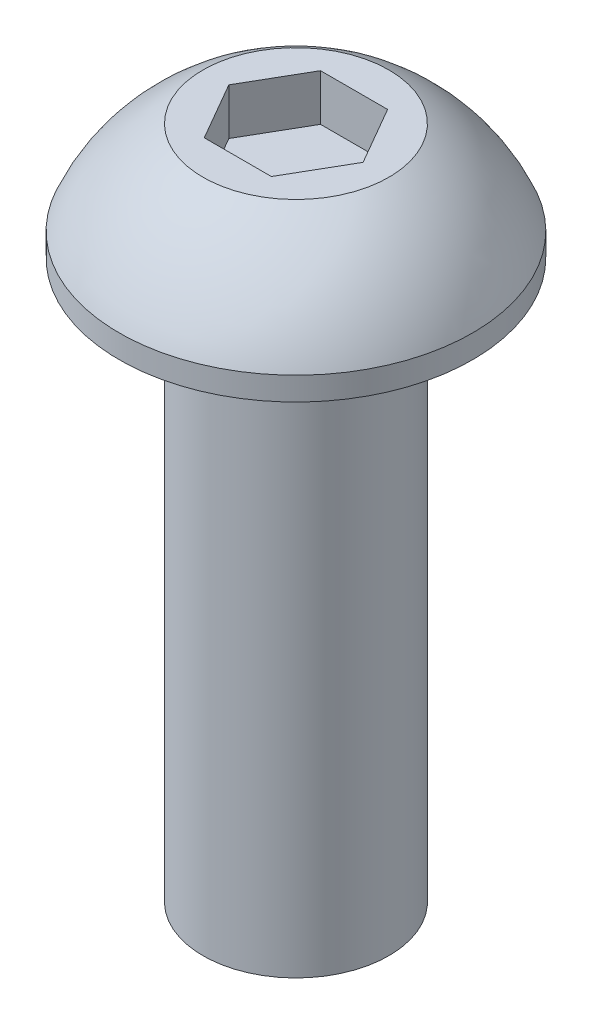
ISO-10303-21;
HEADER;
FILE_DESCRIPTION(('STEP AP214'),'2;1');
FILE_NAME('part.step','',(''),(''),'','','');
FILE_SCHEMA(('AUTOMOTIVE_DESIGN { 1 0 10303 214 1 1 1 1 }'));
ENDSEC;
DATA;
#1=APPLICATION_CONTEXT('core data for automotive mechanical design processes');
#2=APPLICATION_PROTOCOL_DEFINITION('international standard','automotive_design',2000,#1);
#3=PRODUCT_CONTEXT('',#1,'mechanical');
#4=PRODUCT('Part','Part','',(#3));
#5=PRODUCT_RELATED_PRODUCT_CATEGORY('part','',(#4));
#6=PRODUCT_DEFINITION_FORMATION('','',#4);
#7=PRODUCT_DEFINITION_CONTEXT('part definition',#1,'design');
#8=PRODUCT_DEFINITION('design','',#6,#7);
#9=PRODUCT_DEFINITION_SHAPE('','',#8);
#10=(LENGTH_UNIT() NAMED_UNIT(*) SI_UNIT(.MILLI.,.METRE.));
#11=(NAMED_UNIT(*) PLANE_ANGLE_UNIT() SI_UNIT($,.RADIAN.));
#12=(NAMED_UNIT(*) SI_UNIT($,.STERADIAN.) SOLID_ANGLE_UNIT());
#13=UNCERTAINTY_MEASURE_WITH_UNIT(LENGTH_MEASURE(1.E-05),#10,'distance_accuracy_value','');
#14=(GEOMETRIC_REPRESENTATION_CONTEXT(3) GLOBAL_UNCERTAINTY_ASSIGNED_CONTEXT((#13)) GLOBAL_UNIT_ASSIGNED_CONTEXT((#10,
#11,#12)) REPRESENTATION_CONTEXT('',''));
#15=CARTESIAN_POINT('',(0.,0.,0.));
#16=DIRECTION('',(0.,0.,1.));
#17=DIRECTION('',(1.,0.,0.));
#18=AXIS2_PLACEMENT_3D('',#15,#16,#17);
#19=CARTESIAN_POINT('',(0.,-12.,0.));
#20=DIRECTION('',(0.,-1.,0.));
#21=DIRECTION('',(0.,0.,-1.));
#22=AXIS2_PLACEMENT_3D('',#19,#20,#21);
#23=CYLINDRICAL_SURFACE('',#22,2.);
#24=CARTESIAN_POINT('',(0.,0.,0.));
#25=DIRECTION('',(0.,-1.,0.));
#26=DIRECTION('',(0.,0.,-1.));
#27=AXIS2_PLACEMENT_3D('',#24,#25,#26);
#28=CIRCLE('',#27,2.);
#29=CARTESIAN_POINT('',(0.,0.,-2.));
#30=VERTEX_POINT('',#29);
#31=EDGE_CURVE('E11',#30,#30,#28,.T.);
#32=ORIENTED_EDGE('',*,*,#31,.T.);
#33=EDGE_LOOP('',(#32));
#34=FACE_BOUND('',#33,.T.);
#35=CARTESIAN_POINT('',(0.,-12.,0.));
#36=DIRECTION('',(0.,-1.,0.));
#37=DIRECTION('',(0.,0.,-1.));
#38=AXIS2_PLACEMENT_3D('',#35,#36,#37);
#39=CIRCLE('',#38,2.);
#40=CARTESIAN_POINT('',(0.,-12.,-2.));
#41=VERTEX_POINT('',#40);
#42=EDGE_CURVE('E135',#41,#41,#39,.T.);
#43=ORIENTED_EDGE('',*,*,#42,.F.);
#44=EDGE_LOOP('',(#43));
#45=FACE_BOUND('',#44,.T.);
#46=ADVANCED_FACE('F34',(#34,#45),#23,.T.);
#47=CARTESIAN_POINT('',(2.,0.,0.));
#48=DIRECTION('',(0.,-1.,0.));
#49=DIRECTION('',(0.,0.,-1.));
#50=AXIS2_PLACEMENT_3D('',#47,#48,#49);
#51=PLANE('',#50);
#52=CARTESIAN_POINT('',(0.,0.,0.));
#53=DIRECTION('',(0.,-1.,0.));
#54=DIRECTION('',(0.,0.,-1.));
#55=AXIS2_PLACEMENT_3D('',#52,#53,#54);
#56=CIRCLE('',#55,3.8);
#57=CARTESIAN_POINT('',(0.,0.,-3.8));
#58=VERTEX_POINT('',#57);
#59=EDGE_CURVE('E41',#58,#58,#56,.T.);
#60=ORIENTED_EDGE('',*,*,#59,.T.);
#61=EDGE_LOOP('',(#60));
#62=FACE_BOUND('',#61,.T.);
#63=ORIENTED_EDGE('',*,*,#31,.F.);
#64=EDGE_LOOP('',(#63));
#65=FACE_BOUND('',#64,.T.);
#66=ADVANCED_FACE('F151',(#62,#65),#51,.T.);
#67=CARTESIAN_POINT('',(0.,-12.,0.));
#68=DIRECTION('',(0.,-1.,0.));
#69=DIRECTION('',(0.,0.,-1.));
#70=AXIS2_PLACEMENT_3D('',#67,#68,#69);
#71=CYLINDRICAL_SURFACE('',#70,3.8);
#72=CARTESIAN_POINT('',(0.,0.5,0.));
#73=DIRECTION('',(0.,-1.,0.));
#74=DIRECTION('',(0.,0.,-1.));
#75=AXIS2_PLACEMENT_3D('',#72,#73,#74);
#76=CIRCLE('',#75,3.8);
#77=CARTESIAN_POINT('',(0.,0.5,-3.8));
#78=VERTEX_POINT('',#77);
#79=EDGE_CURVE('E146',#78,#78,#76,.T.);
#80=ORIENTED_EDGE('',*,*,#79,.T.);
#81=EDGE_LOOP('',(#80));
#82=FACE_BOUND('',#81,.T.);
#83=ORIENTED_EDGE('',*,*,#59,.F.);
#84=EDGE_LOOP('',(#83));
#85=FACE_BOUND('',#84,.T.);
#86=ADVANCED_FACE('F154',(#82,#85),#71,.T.);
#87=CARTESIAN_POINT('',(0.,-1.01996448278049,0.));
#88=DIRECTION('',(0.,-1.,0.));
#89=DIRECTION('',(0.,0.,-1.));
#90=AXIS2_PLACEMENT_3D('',#87,#88,#89);
#91=DEGENERATE_TOROIDAL_SURFACE('',#90,0.100039463577234,4.,.T.);
#92=CARTESIAN_POINT('',(0.,2.5,0.));
#93=DIRECTION('',(0.,-1.,0.));
#94=DIRECTION('',(0.,0.,-1.));
#95=AXIS2_PLACEMENT_3D('',#92,#93,#94);
#96=CIRCLE('',#95,2.);
#97=CARTESIAN_POINT('',(0.,2.5,-2.));
#98=VERTEX_POINT('',#97);
#99=EDGE_CURVE('E143',#98,#98,#96,.T.);
#100=ORIENTED_EDGE('',*,*,#99,.T.);
#101=EDGE_LOOP('',(#100));
#102=FACE_BOUND('',#101,.T.);
#103=ORIENTED_EDGE('',*,*,#79,.F.);
#104=EDGE_LOOP('',(#103));
#105=FACE_BOUND('',#104,.T.);
#106=ADVANCED_FACE('F156',(#102,#105),#91,.T.);
#107=CARTESIAN_POINT('',(2.,2.5,0.));
#108=DIRECTION('',(0.,1.,0.));
#109=DIRECTION('',(0.,0.,1.));
#110=AXIS2_PLACEMENT_3D('',#107,#108,#109);
#111=PLANE('',#110);
#112=DIRECTION('',(-0.5,0.,-0.866025403784438));
#113=VECTOR('',#112,1.);
#114=CARTESIAN_POINT('',(1.44337567297406,2.5,0.));
#115=LINE('',#114,#113);
#116=CARTESIAN_POINT('',(1.44337567297406,2.5,0.));
#117=VERTEX_POINT('',#116);
#118=CARTESIAN_POINT('',(0.721687836487031,2.5,-1.25));
#119=VERTEX_POINT('',#118);
#120=EDGE_CURVE('E48',#117,#119,#115,.T.);
#121=ORIENTED_EDGE('',*,*,#120,.F.);
#122=DIRECTION('',(0.5,0.,-0.866025403784439));
#123=VECTOR('',#122,1.);
#124=CARTESIAN_POINT('',(0.721687836487032,2.5,1.25));
#125=LINE('',#124,#123);
#126=CARTESIAN_POINT('',(0.721687836487032,2.5,1.25));
#127=VERTEX_POINT('',#126);
#128=EDGE_CURVE('E131',#127,#117,#125,.T.);
#129=ORIENTED_EDGE('',*,*,#128,.F.);
#130=DIRECTION('',(1.,0.,0.));
#131=VECTOR('',#130,1.);
#132=CARTESIAN_POINT('',(-0.721687836487032,2.5,1.25));
#133=LINE('',#132,#131);
#134=CARTESIAN_POINT('',(-0.721687836487032,2.5,1.25));
#135=VERTEX_POINT('',#134);
#136=EDGE_CURVE('E129',#135,#127,#133,.T.);
#137=ORIENTED_EDGE('',*,*,#136,.F.);
#138=DIRECTION('',(0.5,0.,0.866025403784438));
#139=VECTOR('',#138,1.);
#140=CARTESIAN_POINT('',(-1.44337567297406,2.5,0.));
#141=LINE('',#140,#139);
#142=CARTESIAN_POINT('',(-1.44337567297406,2.5,0.));
#143=VERTEX_POINT('',#142);
#144=EDGE_CURVE('E96',#143,#135,#141,.T.);
#145=ORIENTED_EDGE('',*,*,#144,.F.);
#146=DIRECTION('',(-0.5,0.,0.866025403784439));
#147=VECTOR('',#146,1.);
#148=CARTESIAN_POINT('',(-0.721687836487033,2.5,-1.25));
#149=LINE('',#148,#147);
#150=CARTESIAN_POINT('',(-0.721687836487033,2.5,-1.25));
#151=VERTEX_POINT('',#150);
#152=EDGE_CURVE('E125',#151,#143,#149,.T.);
#153=ORIENTED_EDGE('',*,*,#152,.F.);
#154=DIRECTION('',(-1.,0.,0.));
#155=VECTOR('',#154,1.);
#156=CARTESIAN_POINT('',(0.721687836487031,2.5,-1.25));
#157=LINE('',#156,#155);
#158=EDGE_CURVE('E122',#119,#151,#157,.T.);
#159=ORIENTED_EDGE('',*,*,#158,.F.);
#160=EDGE_LOOP('',(#121,#129,#137,#145,#153,#159));
#161=FACE_BOUND('',#160,.T.);
#162=ORIENTED_EDGE('',*,*,#99,.F.);
#163=EDGE_LOOP('',(#162));
#164=FACE_BOUND('',#163,.T.);
#165=ADVANCED_FACE('F163',(#161,#164),#111,.T.);
#166=CARTESIAN_POINT('',(2.,-12.,0.));
#167=DIRECTION('',(0.,-1.,0.));
#168=DIRECTION('',(0.,0.,-1.));
#169=AXIS2_PLACEMENT_3D('',#166,#167,#168);
#170=PLANE('',#169);
#171=ORIENTED_EDGE('',*,*,#42,.T.);
#172=EDGE_LOOP('',(#171));
#173=FACE_BOUND('',#172,.T.);
#174=ADVANCED_FACE('F174',(#173),#170,.T.);
#175=CARTESIAN_POINT('',(1.44337567297406,1.5,0.));
#176=DIRECTION('',(0.866025403784438,0.,-0.5));
#177=DIRECTION('',(-0.5,0.,-0.866025403784438));
#178=AXIS2_PLACEMENT_3D('',#175,#176,#177);
#179=PLANE('',#178);
#180=ORIENTED_EDGE('',*,*,#120,.T.);
#181=DIRECTION('',(0.,1.,0.));
#182=VECTOR('',#181,1.);
#183=CARTESIAN_POINT('',(0.721687836487031,1.5,-1.25));
#184=LINE('',#183,#182);
#185=CARTESIAN_POINT('',(0.721687836487031,1.5,-1.25));
#186=VERTEX_POINT('',#185);
#187=EDGE_CURVE('E78',#186,#119,#184,.T.);
#188=ORIENTED_EDGE('',*,*,#187,.F.);
#189=DIRECTION('',(-0.5,0.,-0.866025403784438));
#190=VECTOR('',#189,1.);
#191=CARTESIAN_POINT('',(1.44337567297406,1.5,0.));
#192=LINE('',#191,#190);
#193=CARTESIAN_POINT('',(1.44337567297406,1.5,0.));
#194=VERTEX_POINT('',#193);
#195=EDGE_CURVE('E133',#194,#186,#192,.T.);
#196=ORIENTED_EDGE('',*,*,#195,.F.);
#197=DIRECTION('',(0.,1.,0.));
#198=VECTOR('',#197,1.);
#199=CARTESIAN_POINT('',(1.44337567297406,1.5,0.));
#200=LINE('',#199,#198);
#201=EDGE_CURVE('E56',#194,#117,#200,.T.);
#202=ORIENTED_EDGE('',*,*,#201,.T.);
#203=EDGE_LOOP('',(#180,#188,#196,#202));
#204=FACE_BOUND('',#203,.T.);
#205=ADVANCED_FACE('F176',(#204),#179,.F.);
#206=CARTESIAN_POINT('',(0.721687836487032,1.5,1.25));
#207=DIRECTION('',(0.866025403784439,0.,0.5));
#208=DIRECTION('',(0.5,0.,-0.866025403784439));
#209=AXIS2_PLACEMENT_3D('',#206,#207,#208);
#210=PLANE('',#209);
#211=ORIENTED_EDGE('',*,*,#128,.T.);
#212=ORIENTED_EDGE('',*,*,#201,.F.);
#213=DIRECTION('',(0.5,0.,-0.866025403784439));
#214=VECTOR('',#213,1.);
#215=CARTESIAN_POINT('',(0.721687836487032,1.5,1.25));
#216=LINE('',#215,#214);
#217=CARTESIAN_POINT('',(0.721687836487032,1.5,1.25));
#218=VERTEX_POINT('',#217);
#219=EDGE_CURVE('E108',#218,#194,#216,.T.);
#220=ORIENTED_EDGE('',*,*,#219,.F.);
#221=DIRECTION('',(0.,1.,0.));
#222=VECTOR('',#221,1.);
#223=CARTESIAN_POINT('',(0.721687836487032,1.5,1.25));
#224=LINE('',#223,#222);
#225=EDGE_CURVE('E100',#218,#127,#224,.T.);
#226=ORIENTED_EDGE('',*,*,#225,.T.);
#227=EDGE_LOOP('',(#211,#212,#220,#226));
#228=FACE_BOUND('',#227,.T.);
#229=ADVANCED_FACE('F182',(#228),#210,.F.);
#230=CARTESIAN_POINT('',(-0.721687836487032,1.5,1.25));
#231=DIRECTION('',(0.,0.,1.));
#232=DIRECTION('',(1.,0.,0.));
#233=AXIS2_PLACEMENT_3D('',#230,#231,#232);
#234=PLANE('',#233);
#235=ORIENTED_EDGE('',*,*,#136,.T.);
#236=ORIENTED_EDGE('',*,*,#225,.F.);
#237=DIRECTION('',(1.,0.,0.));
#238=VECTOR('',#237,1.);
#239=CARTESIAN_POINT('',(-0.721687836487032,1.5,1.25));
#240=LINE('',#239,#238);
#241=CARTESIAN_POINT('',(-0.721687836487032,1.5,1.25));
#242=VERTEX_POINT('',#241);
#243=EDGE_CURVE('E104',#242,#218,#240,.T.);
#244=ORIENTED_EDGE('',*,*,#243,.F.);
#245=DIRECTION('',(0.,1.,0.));
#246=VECTOR('',#245,1.);
#247=CARTESIAN_POINT('',(-0.721687836487032,1.5,1.25));
#248=LINE('',#247,#246);
#249=EDGE_CURVE('E89',#242,#135,#248,.T.);
#250=ORIENTED_EDGE('',*,*,#249,.T.);
#251=EDGE_LOOP('',(#235,#236,#244,#250));
#252=FACE_BOUND('',#251,.T.);
#253=ADVANCED_FACE('F105',(#252),#234,.F.);
#254=CARTESIAN_POINT('',(-1.44337567297406,1.5,0.));
#255=DIRECTION('',(-0.866025403784438,0.,0.5));
#256=DIRECTION('',(0.5,0.,0.866025403784438));
#257=AXIS2_PLACEMENT_3D('',#254,#255,#256);
#258=PLANE('',#257);
#259=ORIENTED_EDGE('',*,*,#144,.T.);
#260=ORIENTED_EDGE('',*,*,#249,.F.);
#261=DIRECTION('',(0.5,0.,0.866025403784438));
#262=VECTOR('',#261,1.);
#263=CARTESIAN_POINT('',(-1.44337567297406,1.5,0.));
#264=LINE('',#263,#262);
#265=CARTESIAN_POINT('',(-1.44337567297406,1.5,0.));
#266=VERTEX_POINT('',#265);
#267=EDGE_CURVE('E93',#266,#242,#264,.T.);
#268=ORIENTED_EDGE('',*,*,#267,.F.);
#269=DIRECTION('',(0.,1.,0.));
#270=VECTOR('',#269,1.);
#271=CARTESIAN_POINT('',(-1.44337567297406,1.5,0.));
#272=LINE('',#271,#270);
#273=EDGE_CURVE('E101',#266,#143,#272,.T.);
#274=ORIENTED_EDGE('',*,*,#273,.T.);
#275=EDGE_LOOP('',(#259,#260,#268,#274));
#276=FACE_BOUND('',#275,.T.);
#277=ADVANCED_FACE('F91',(#276),#258,.F.);
#278=CARTESIAN_POINT('',(-0.721687836487033,1.5,-1.25));
#279=DIRECTION('',(-0.866025403784439,0.,-0.5));
#280=DIRECTION('',(-0.5,0.,0.866025403784439));
#281=AXIS2_PLACEMENT_3D('',#278,#279,#280);
#282=PLANE('',#281);
#283=ORIENTED_EDGE('',*,*,#152,.T.);
#284=ORIENTED_EDGE('',*,*,#273,.F.);
#285=DIRECTION('',(-0.5,0.,0.866025403784439));
#286=VECTOR('',#285,1.);
#287=CARTESIAN_POINT('',(-0.721687836487033,1.5,-1.25));
#288=LINE('',#287,#286);
#289=CARTESIAN_POINT('',(-0.721687836487033,1.5,-1.25));
#290=VERTEX_POINT('',#289);
#291=EDGE_CURVE('E114',#290,#266,#288,.T.);
#292=ORIENTED_EDGE('',*,*,#291,.F.);
#293=DIRECTION('',(0.,1.,0.));
#294=VECTOR('',#293,1.);
#295=CARTESIAN_POINT('',(-0.721687836487033,1.5,-1.25));
#296=LINE('',#295,#294);
#297=EDGE_CURVE('E138',#290,#151,#296,.T.);
#298=ORIENTED_EDGE('',*,*,#297,.T.);
#299=EDGE_LOOP('',(#283,#284,#292,#298));
#300=FACE_BOUND('',#299,.T.);
#301=ADVANCED_FACE('F190',(#300),#282,.F.);
#302=CARTESIAN_POINT('',(0.721687836487031,1.5,-1.25));
#303=DIRECTION('',(0.,0.,-1.));
#304=DIRECTION('',(-1.,0.,0.));
#305=AXIS2_PLACEMENT_3D('',#302,#303,#304);
#306=PLANE('',#305);
#307=ORIENTED_EDGE('',*,*,#158,.T.);
#308=ORIENTED_EDGE('',*,*,#297,.F.);
#309=DIRECTION('',(-1.,0.,0.));
#310=VECTOR('',#309,1.);
#311=CARTESIAN_POINT('',(0.721687836487031,1.5,-1.25));
#312=LINE('',#311,#310);
#313=EDGE_CURVE('E116',#186,#290,#312,.T.);
#314=ORIENTED_EDGE('',*,*,#313,.F.);
#315=ORIENTED_EDGE('',*,*,#187,.T.);
#316=EDGE_LOOP('',(#307,#308,#314,#315));
#317=FACE_BOUND('',#316,.T.);
#318=ADVANCED_FACE('F187',(#317),#306,.F.);
#319=CARTESIAN_POINT('',(0.,1.5,0.));
#320=DIRECTION('',(0.,1.,0.));
#321=DIRECTION('',(0.,0.,1.));
#322=AXIS2_PLACEMENT_3D('',#319,#320,#321);
#323=PLANE('',#322);
#324=ORIENTED_EDGE('',*,*,#195,.T.);
#325=ORIENTED_EDGE('',*,*,#313,.T.);
#326=ORIENTED_EDGE('',*,*,#291,.T.);
#327=ORIENTED_EDGE('',*,*,#267,.T.);
#328=ORIENTED_EDGE('',*,*,#243,.T.);
#329=ORIENTED_EDGE('',*,*,#219,.T.);
#330=EDGE_LOOP('',(#324,#325,#326,#327,#328,#329));
#331=FACE_BOUND('',#330,.T.);
#332=ADVANCED_FACE('F111',(#331),#323,.T.);
#333=CLOSED_SHELL('',(#46,#66,#86,#106,#165,#174,#205,#229,#253,#277,#301,#318,#332));
#334=MANIFOLD_SOLID_BREP('B2',#333);
#335=ADVANCED_BREP_SHAPE_REPRESENTATION('',(#18,#334),#14);
#336=SHAPE_DEFINITION_REPRESENTATION(#9,#335);
ENDSEC;
END-ISO-10303-21;
